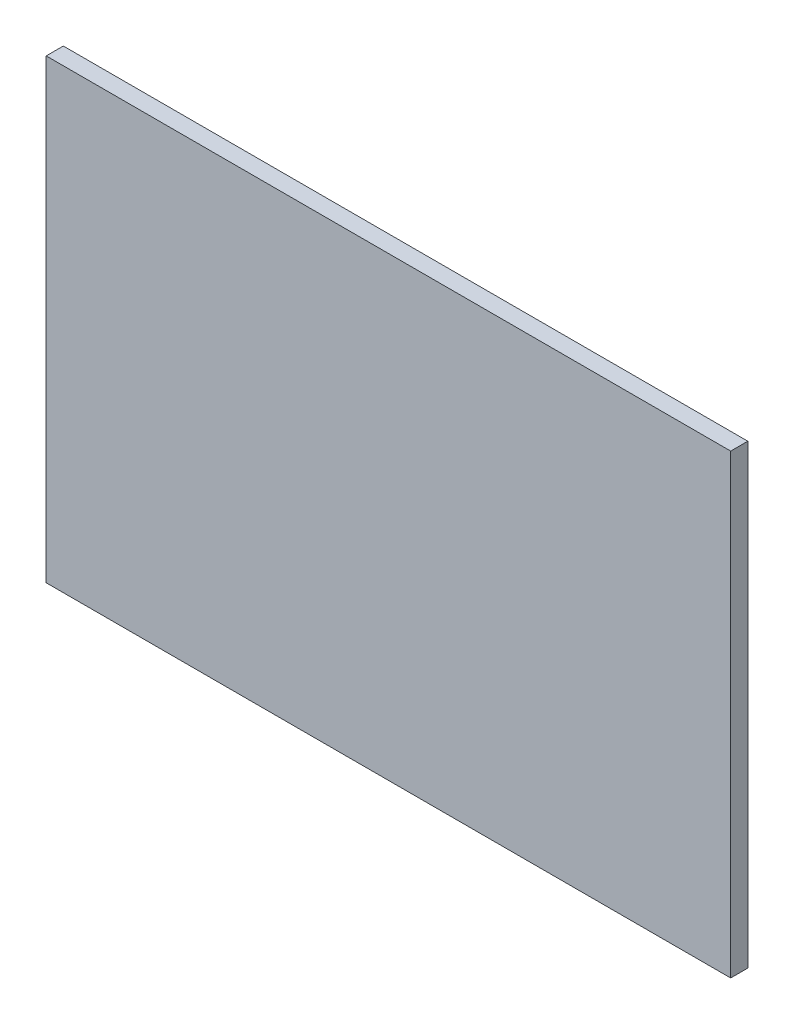
ISO-10303-21;
HEADER;
FILE_DESCRIPTION(('STEP AP214'),'2;1');
FILE_NAME('part.step','',(''),(''),'','','');
FILE_SCHEMA(('AUTOMOTIVE_DESIGN { 1 0 10303 214 1 1 1 1 }'));
ENDSEC;
DATA;
#1=APPLICATION_CONTEXT('core data for automotive mechanical design processes');
#2=APPLICATION_PROTOCOL_DEFINITION('international standard','automotive_design',2000,#1);
#3=PRODUCT_CONTEXT('',#1,'mechanical');
#4=PRODUCT('Part','Part','',(#3));
#5=PRODUCT_RELATED_PRODUCT_CATEGORY('part','',(#4));
#6=PRODUCT_DEFINITION_FORMATION('','',#4);
#7=PRODUCT_DEFINITION_CONTEXT('part definition',#1,'design');
#8=PRODUCT_DEFINITION('design','',#6,#7);
#9=PRODUCT_DEFINITION_SHAPE('','',#8);
#10=(LENGTH_UNIT() NAMED_UNIT(*) SI_UNIT(.MILLI.,.METRE.));
#11=(NAMED_UNIT(*) PLANE_ANGLE_UNIT() SI_UNIT($,.RADIAN.));
#12=(NAMED_UNIT(*) SI_UNIT($,.STERADIAN.) SOLID_ANGLE_UNIT());
#13=UNCERTAINTY_MEASURE_WITH_UNIT(LENGTH_MEASURE(1.E-05),#10,'distance_accuracy_value','');
#14=(GEOMETRIC_REPRESENTATION_CONTEXT(3) GLOBAL_UNCERTAINTY_ASSIGNED_CONTEXT((#13)) GLOBAL_UNIT_ASSIGNED_CONTEXT((#10,
#11,#12)) REPRESENTATION_CONTEXT('',''));
#15=CARTESIAN_POINT('',(0.,0.,0.));
#16=DIRECTION('',(0.,0.,1.));
#17=DIRECTION('',(1.,0.,0.));
#18=AXIS2_PLACEMENT_3D('',#15,#16,#17);
#19=CARTESIAN_POINT('',(-300.,200.,15.));
#20=DIRECTION('',(1.,0.,0.));
#21=DIRECTION('',(0.,1.,0.));
#22=AXIS2_PLACEMENT_3D('',#19,#20,#21);
#23=PLANE('',#22);
#24=DIRECTION('',(0.,-1.,0.));
#25=VECTOR('',#24,1.);
#26=CARTESIAN_POINT('',(-300.,200.,0.));
#27=LINE('',#26,#25);
#28=CARTESIAN_POINT('',(-300.,200.,0.));
#29=VERTEX_POINT('',#28);
#30=CARTESIAN_POINT('',(-300.,-200.,0.));
#31=VERTEX_POINT('',#30);
#32=EDGE_CURVE('E96',#29,#31,#27,.T.);
#33=ORIENTED_EDGE('',*,*,#32,.T.);
#34=DIRECTION('',(0.,0.,-1.));
#35=VECTOR('',#34,1.);
#36=CARTESIAN_POINT('',(-300.,-200.,15.));
#37=LINE('',#36,#35);
#38=CARTESIAN_POINT('',(-300.,-200.,15.));
#39=VERTEX_POINT('',#38);
#40=EDGE_CURVE('E11',#39,#31,#37,.T.);
#41=ORIENTED_EDGE('',*,*,#40,.F.);
#42=DIRECTION('',(0.,-1.,0.));
#43=VECTOR('',#42,1.);
#44=CARTESIAN_POINT('',(-300.,200.,15.));
#45=LINE('',#44,#43);
#46=CARTESIAN_POINT('',(-300.,200.,15.));
#47=VERTEX_POINT('',#46);
#48=EDGE_CURVE('E84',#47,#39,#45,.T.);
#49=ORIENTED_EDGE('',*,*,#48,.F.);
#50=DIRECTION('',(0.,0.,-1.));
#51=VECTOR('',#50,1.);
#52=CARTESIAN_POINT('',(-300.,200.,15.));
#53=LINE('',#52,#51);
#54=EDGE_CURVE('E92',#47,#29,#53,.T.);
#55=ORIENTED_EDGE('',*,*,#54,.T.);
#56=EDGE_LOOP('',(#33,#41,#49,#55));
#57=FACE_BOUND('',#56,.T.);
#58=ADVANCED_FACE('F33',(#57),#23,.F.);
#59=CARTESIAN_POINT('',(-300.,-200.,15.));
#60=DIRECTION('',(0.,1.,0.));
#61=DIRECTION('',(0.,0.,1.));
#62=AXIS2_PLACEMENT_3D('',#59,#60,#61);
#63=PLANE('',#62);
#64=DIRECTION('',(1.,0.,0.));
#65=VECTOR('',#64,1.);
#66=CARTESIAN_POINT('',(-300.,-200.,0.));
#67=LINE('',#66,#65);
#68=CARTESIAN_POINT('',(300.,-200.,0.));
#69=VERTEX_POINT('',#68);
#70=EDGE_CURVE('E88',#31,#69,#67,.T.);
#71=ORIENTED_EDGE('',*,*,#70,.T.);
#72=DIRECTION('',(0.,0.,-1.));
#73=VECTOR('',#72,1.);
#74=CARTESIAN_POINT('',(300.,-200.,15.));
#75=LINE('',#74,#73);
#76=CARTESIAN_POINT('',(300.,-200.,15.));
#77=VERTEX_POINT('',#76);
#78=EDGE_CURVE('E41',#77,#69,#75,.T.);
#79=ORIENTED_EDGE('',*,*,#78,.F.);
#80=DIRECTION('',(1.,0.,0.));
#81=VECTOR('',#80,1.);
#82=CARTESIAN_POINT('',(-300.,-200.,15.));
#83=LINE('',#82,#81);
#84=EDGE_CURVE('E79',#39,#77,#83,.T.);
#85=ORIENTED_EDGE('',*,*,#84,.F.);
#86=ORIENTED_EDGE('',*,*,#40,.T.);
#87=EDGE_LOOP('',(#71,#79,#85,#86));
#88=FACE_BOUND('',#87,.T.);
#89=ADVANCED_FACE('F87',(#88),#63,.F.);
#90=CARTESIAN_POINT('',(300.,200.,15.));
#91=DIRECTION('',(-1.,0.,0.));
#92=DIRECTION('',(0.,0.,1.));
#93=AXIS2_PLACEMENT_3D('',#90,#91,#92);
#94=PLANE('',#93);
#95=DIRECTION('',(0.,1.,0.));
#96=VECTOR('',#95,1.);
#97=CARTESIAN_POINT('',(300.,200.,0.));
#98=LINE('',#97,#96);
#99=CARTESIAN_POINT('',(300.,200.,0.));
#100=VERTEX_POINT('',#99);
#101=EDGE_CURVE('E66',#69,#100,#98,.T.);
#102=ORIENTED_EDGE('',*,*,#101,.T.);
#103=DIRECTION('',(0.,0.,-1.));
#104=VECTOR('',#103,1.);
#105=CARTESIAN_POINT('',(300.,200.,15.));
#106=LINE('',#105,#104);
#107=CARTESIAN_POINT('',(300.,200.,15.));
#108=VERTEX_POINT('',#107);
#109=EDGE_CURVE('E89',#108,#100,#106,.T.);
#110=ORIENTED_EDGE('',*,*,#109,.F.);
#111=DIRECTION('',(0.,1.,0.));
#112=VECTOR('',#111,1.);
#113=CARTESIAN_POINT('',(300.,200.,15.));
#114=LINE('',#113,#112);
#115=EDGE_CURVE('E82',#77,#108,#114,.T.);
#116=ORIENTED_EDGE('',*,*,#115,.F.);
#117=ORIENTED_EDGE('',*,*,#78,.T.);
#118=EDGE_LOOP('',(#102,#110,#116,#117));
#119=FACE_BOUND('',#118,.T.);
#120=ADVANCED_FACE('F90',(#119),#94,.F.);
#121=CARTESIAN_POINT('',(-300.,200.,15.));
#122=DIRECTION('',(0.,-1.,0.));
#123=DIRECTION('',(0.,0.,-1.));
#124=AXIS2_PLACEMENT_3D('',#121,#122,#123);
#125=PLANE('',#124);
#126=DIRECTION('',(-1.,0.,0.));
#127=VECTOR('',#126,1.);
#128=CARTESIAN_POINT('',(-300.,200.,0.));
#129=LINE('',#128,#127);
#130=EDGE_CURVE('E72',#100,#29,#129,.T.);
#131=ORIENTED_EDGE('',*,*,#130,.T.);
#132=ORIENTED_EDGE('',*,*,#54,.F.);
#133=DIRECTION('',(-1.,0.,0.));
#134=VECTOR('',#133,1.);
#135=CARTESIAN_POINT('',(-300.,200.,15.));
#136=LINE('',#135,#134);
#137=EDGE_CURVE('E49',#108,#47,#136,.T.);
#138=ORIENTED_EDGE('',*,*,#137,.F.);
#139=ORIENTED_EDGE('',*,*,#109,.T.);
#140=EDGE_LOOP('',(#131,#132,#138,#139));
#141=FACE_BOUND('',#140,.T.);
#142=ADVANCED_FACE('F103',(#141),#125,.F.);
#143=CARTESIAN_POINT('',(0.,0.,15.));
#144=DIRECTION('',(0.,0.,1.));
#145=DIRECTION('',(1.,0.,0.));
#146=AXIS2_PLACEMENT_3D('',#143,#144,#145);
#147=PLANE('',#146);
#148=ORIENTED_EDGE('',*,*,#48,.T.);
#149=ORIENTED_EDGE('',*,*,#84,.T.);
#150=ORIENTED_EDGE('',*,*,#115,.T.);
#151=ORIENTED_EDGE('',*,*,#137,.T.);
#152=EDGE_LOOP('',(#148,#149,#150,#151));
#153=FACE_BOUND('',#152,.T.);
#154=ADVANCED_FACE('F80',(#153),#147,.T.);
#155=CARTESIAN_POINT('',(0.,0.,0.));
#156=DIRECTION('',(0.,0.,1.));
#157=DIRECTION('',(1.,0.,0.));
#158=AXIS2_PLACEMENT_3D('',#155,#156,#157);
#159=PLANE('',#158);
#160=ORIENTED_EDGE('',*,*,#32,.F.);
#161=ORIENTED_EDGE('',*,*,#130,.F.);
#162=ORIENTED_EDGE('',*,*,#101,.F.);
#163=ORIENTED_EDGE('',*,*,#70,.F.);
#164=EDGE_LOOP('',(#160,#161,#162,#163));
#165=FACE_BOUND('',#164,.T.);
#166=ADVANCED_FACE('F106',(#165),#159,.F.);
#167=CLOSED_SHELL('',(#58,#89,#120,#142,#154,#166));
#168=MANIFOLD_SOLID_BREP('B2',#167);
#169=ADVANCED_BREP_SHAPE_REPRESENTATION('',(#18,#168),#14);
#170=SHAPE_DEFINITION_REPRESENTATION(#9,#169);
ENDSEC;
END-ISO-10303-21;
